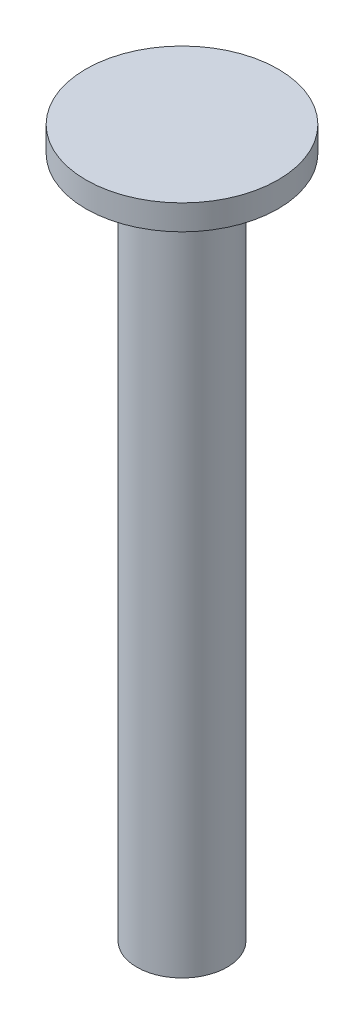
ISO-10303-21;
HEADER;
FILE_DESCRIPTION(('STEP AP214'),'2;1');
FILE_NAME('part.step','',(''),(''),'','','');
FILE_SCHEMA(('AUTOMOTIVE_DESIGN { 1 0 10303 214 1 1 1 1 }'));
ENDSEC;
DATA;
#1=APPLICATION_CONTEXT('core data for automotive mechanical design processes');
#2=APPLICATION_PROTOCOL_DEFINITION('international standard','automotive_design',2000,#1);
#3=PRODUCT_CONTEXT('',#1,'mechanical');
#4=PRODUCT('Part','Part','',(#3));
#5=PRODUCT_RELATED_PRODUCT_CATEGORY('part','',(#4));
#6=PRODUCT_DEFINITION_FORMATION('','',#4);
#7=PRODUCT_DEFINITION_CONTEXT('part definition',#1,'design');
#8=PRODUCT_DEFINITION('design','',#6,#7);
#9=PRODUCT_DEFINITION_SHAPE('','',#8);
#10=(LENGTH_UNIT() NAMED_UNIT(*) SI_UNIT(.MILLI.,.METRE.));
#11=(NAMED_UNIT(*) PLANE_ANGLE_UNIT() SI_UNIT($,.RADIAN.));
#12=(NAMED_UNIT(*) SI_UNIT($,.STERADIAN.) SOLID_ANGLE_UNIT());
#13=UNCERTAINTY_MEASURE_WITH_UNIT(LENGTH_MEASURE(1.E-05),#10,'distance_accuracy_value','');
#14=(GEOMETRIC_REPRESENTATION_CONTEXT(3) GLOBAL_UNCERTAINTY_ASSIGNED_CONTEXT((#13)) GLOBAL_UNIT_ASSIGNED_CONTEXT((#10,
#11,#12)) REPRESENTATION_CONTEXT('',''));
#15=CARTESIAN_POINT('',(0.,0.,0.));
#16=DIRECTION('',(0.,0.,1.));
#17=DIRECTION('',(1.,0.,0.));
#18=AXIS2_PLACEMENT_3D('',#15,#16,#17);
#19=CARTESIAN_POINT('',(8.11516922133723,-64.9363950727944,1.31900985242734));
#20=DIRECTION('',(0.,1.,0.));
#21=DIRECTION('',(0.,0.,1.));
#22=AXIS2_PLACEMENT_3D('',#19,#20,#21);
#23=CYLINDRICAL_SURFACE('',#22,1.14411506);
#24=CARTESIAN_POINT('',(8.11516922133723,-64.9363950727944,1.31900985242734));
#25=DIRECTION('',(0.,1.,0.));
#26=DIRECTION('',(0.,0.,1.));
#27=AXIS2_PLACEMENT_3D('',#24,#25,#26);
#28=CIRCLE('',#27,1.14411506);
#29=CARTESIAN_POINT('',(8.11516922133723,-64.9363950727944,2.46312491242734));
#30=VERTEX_POINT('',#29);
#31=EDGE_CURVE('E10',#30,#30,#28,.T.);
#32=ORIENTED_EDGE('',*,*,#31,.T.);
#33=EDGE_LOOP('',(#32));
#34=FACE_BOUND('',#33,.T.);
#35=CARTESIAN_POINT('',(8.11516922133723,-47.6663950727943,1.31900985242734));
#36=DIRECTION('',(0.,1.,0.));
#37=DIRECTION('',(0.,0.,1.));
#38=AXIS2_PLACEMENT_3D('',#35,#36,#37);
#39=CIRCLE('',#38,1.14411506);
#40=CARTESIAN_POINT('',(8.11516922133723,-47.6663950727943,2.46312491242734));
#41=VERTEX_POINT('',#40);
#42=EDGE_CURVE('E40',#41,#41,#39,.T.);
#43=ORIENTED_EDGE('',*,*,#42,.F.);
#44=EDGE_LOOP('',(#43));
#45=FACE_BOUND('',#44,.T.);
#46=ADVANCED_FACE('F37',(#34,#45),#23,.T.);
#47=CARTESIAN_POINT('',(8.11516922133723,-64.9363950727944,1.31900985242734));
#48=DIRECTION('',(0.,1.,0.));
#49=DIRECTION('',(0.,0.,1.));
#50=AXIS2_PLACEMENT_3D('',#47,#48,#49);
#51=PLANE('',#50);
#52=ORIENTED_EDGE('',*,*,#31,.F.);
#53=EDGE_LOOP('',(#52));
#54=FACE_BOUND('',#53,.T.);
#55=ADVANCED_FACE('F60',(#54),#51,.F.);
#56=CARTESIAN_POINT('',(8.11516922133723,-47.0313950727944,1.31900985242734));
#57=DIRECTION('',(0.,-1.,0.));
#58=DIRECTION('',(0.,0.,-1.));
#59=AXIS2_PLACEMENT_3D('',#56,#57,#58);
#60=CYLINDRICAL_SURFACE('',#59,2.43260359907292);
#61=CARTESIAN_POINT('',(8.11516922133723,-47.0313950727944,1.31900985242734));
#62=DIRECTION('',(0.,1.,0.));
#63=DIRECTION('',(0.,0.,1.));
#64=AXIS2_PLACEMENT_3D('',#61,#62,#63);
#65=CIRCLE('',#64,2.43260359907292);
#66=CARTESIAN_POINT('',(8.11516922133723,-47.0313950727944,3.75161345150026));
#67=VERTEX_POINT('',#66);
#68=EDGE_CURVE('E47',#67,#67,#65,.T.);
#69=ORIENTED_EDGE('',*,*,#68,.F.);
#70=EDGE_LOOP('',(#69));
#71=FACE_BOUND('',#70,.T.);
#72=CARTESIAN_POINT('',(8.11516922133723,-47.6663950727943,1.31900985242734));
#73=DIRECTION('',(0.,1.,0.));
#74=DIRECTION('',(0.,0.,1.));
#75=AXIS2_PLACEMENT_3D('',#72,#73,#74);
#76=CIRCLE('',#75,2.43260359907292);
#77=CARTESIAN_POINT('',(8.11516922133723,-47.6663950727943,3.75161345150026));
#78=VERTEX_POINT('',#77);
#79=EDGE_CURVE('E49',#78,#78,#76,.T.);
#80=ORIENTED_EDGE('',*,*,#79,.T.);
#81=EDGE_LOOP('',(#80));
#82=FACE_BOUND('',#81,.T.);
#83=ADVANCED_FACE('F57',(#71,#82),#60,.T.);
#84=CARTESIAN_POINT('',(8.11516922133723,-47.0313950727944,1.31900985242734));
#85=DIRECTION('',(0.,1.,0.));
#86=DIRECTION('',(0.,0.,1.));
#87=AXIS2_PLACEMENT_3D('',#84,#85,#86);
#88=PLANE('',#87);
#89=ORIENTED_EDGE('',*,*,#68,.T.);
#90=EDGE_LOOP('',(#89));
#91=FACE_BOUND('',#90,.T.);
#92=ADVANCED_FACE('F55',(#91),#88,.T.);
#93=CARTESIAN_POINT('',(8.11516922133723,-47.6663950727943,1.31900985242734));
#94=DIRECTION('',(0.,1.,0.));
#95=DIRECTION('',(0.,0.,1.));
#96=AXIS2_PLACEMENT_3D('',#93,#94,#95);
#97=PLANE('',#96);
#98=ORIENTED_EDGE('',*,*,#42,.T.);
#99=EDGE_LOOP('',(#98));
#100=FACE_BOUND('',#99,.T.);
#101=ORIENTED_EDGE('',*,*,#79,.F.);
#102=EDGE_LOOP('',(#101));
#103=FACE_BOUND('',#102,.T.);
#104=ADVANCED_FACE('F64',(#100,#103),#97,.F.);
#105=CLOSED_SHELL('',(#46,#55,#83,#92,#104));
#106=MANIFOLD_SOLID_BREP('B2',#105);
#107=ADVANCED_BREP_SHAPE_REPRESENTATION('',(#18,#106),#14);
#108=SHAPE_DEFINITION_REPRESENTATION(#9,#107);
ENDSEC;
END-ISO-10303-21;
